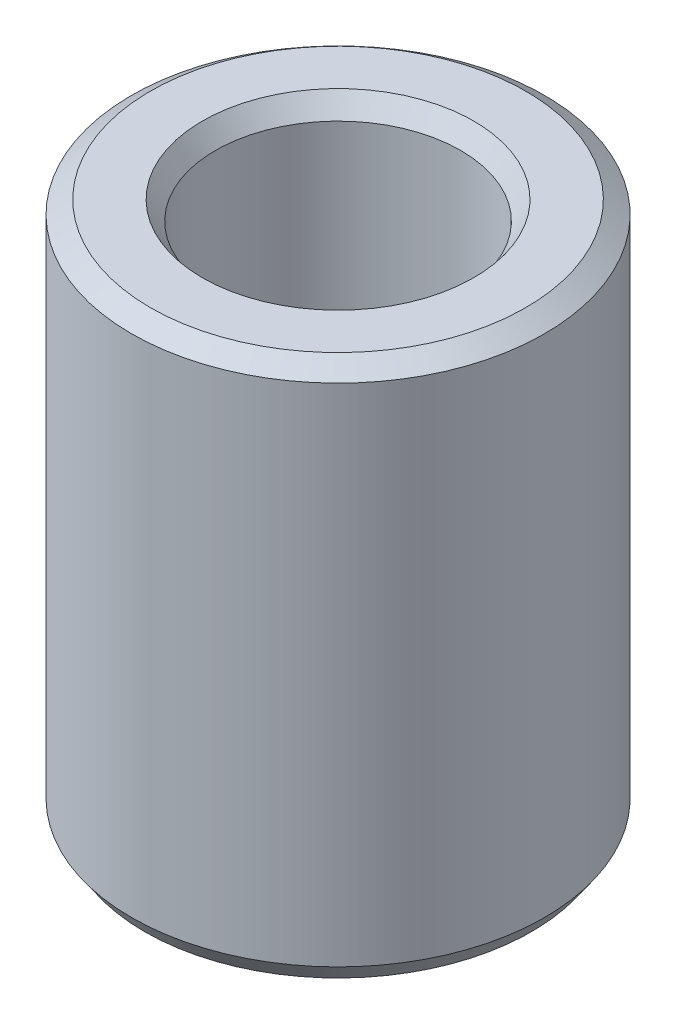
ISO-10303-21;
HEADER;
FILE_DESCRIPTION(('STEP AP214'),'2;1');
FILE_NAME('part.step','',(''),(''),'','','');
FILE_SCHEMA(('AUTOMOTIVE_DESIGN { 1 0 10303 214 1 1 1 1 }'));
ENDSEC;
DATA;
#1=APPLICATION_CONTEXT('core data for automotive mechanical design processes');
#2=APPLICATION_PROTOCOL_DEFINITION('international standard','automotive_design',2000,#1);
#3=PRODUCT_CONTEXT('',#1,'mechanical');
#4=PRODUCT('Part','Part','',(#3));
#5=PRODUCT_RELATED_PRODUCT_CATEGORY('part','',(#4));
#6=PRODUCT_DEFINITION_FORMATION('','',#4);
#7=PRODUCT_DEFINITION_CONTEXT('part definition',#1,'design');
#8=PRODUCT_DEFINITION('design','',#6,#7);
#9=PRODUCT_DEFINITION_SHAPE('','',#8);
#10=(LENGTH_UNIT() NAMED_UNIT(*) SI_UNIT(.MILLI.,.METRE.));
#11=(NAMED_UNIT(*) PLANE_ANGLE_UNIT() SI_UNIT($,.RADIAN.));
#12=(NAMED_UNIT(*) SI_UNIT($,.STERADIAN.) SOLID_ANGLE_UNIT());
#13=UNCERTAINTY_MEASURE_WITH_UNIT(LENGTH_MEASURE(1.E-05),#10,'distance_accuracy_value','');
#14=(GEOMETRIC_REPRESENTATION_CONTEXT(3) GLOBAL_UNCERTAINTY_ASSIGNED_CONTEXT((#13)) GLOBAL_UNIT_ASSIGNED_CONTEXT((#10,
#11,#12)) REPRESENTATION_CONTEXT('',''));
#15=CARTESIAN_POINT('',(0.,0.,0.));
#16=DIRECTION('',(0.,0.,1.));
#17=DIRECTION('',(1.,0.,0.));
#18=AXIS2_PLACEMENT_3D('',#15,#16,#17);
#19=CARTESIAN_POINT('',(0.,143.177631376907,0.));
#20=DIRECTION('',(0.,-1.,0.));
#21=DIRECTION('',(0.,0.,-1.));
#22=AXIS2_PLACEMENT_3D('',#19,#20,#21);
#23=CYLINDRICAL_SURFACE('',#22,55.);
#24=CARTESIAN_POINT('',(0.,5.03157090102677,0.));
#25=DIRECTION('',(0.,1.,0.));
#26=DIRECTION('',(0.,0.,1.));
#27=AXIS2_PLACEMENT_3D('',#24,#25,#26);
#28=CIRCLE('',#27,55.);
#29=CARTESIAN_POINT('',(0.,5.03157090102677,55.));
#30=VERTEX_POINT('',#29);
#31=EDGE_CURVE('E10',#30,#30,#28,.T.);
#32=ORIENTED_EDGE('',*,*,#31,.T.);
#33=EDGE_LOOP('',(#32));
#34=FACE_BOUND('',#33,.T.);
#35=CARTESIAN_POINT('',(0.,139.681117191174,0.));
#36=DIRECTION('',(0.,1.,0.));
#37=DIRECTION('',(0.,0.,1.));
#38=AXIS2_PLACEMENT_3D('',#35,#36,#37);
#39=CIRCLE('',#38,55.);
#40=CARTESIAN_POINT('',(0.,139.681117191174,55.));
#41=VERTEX_POINT('',#40);
#42=EDGE_CURVE('E50',#41,#41,#39,.F.);
#43=ORIENTED_EDGE('',*,*,#42,.T.);
#44=EDGE_LOOP('',(#43));
#45=FACE_BOUND('',#44,.T.);
#46=ADVANCED_FACE('F39',(#34,#45),#23,.T.);
#47=CARTESIAN_POINT('',(0.,143.177631376907,0.));
#48=DIRECTION('',(0.,1.,0.));
#49=DIRECTION('',(0.,0.,1.));
#50=AXIS2_PLACEMENT_3D('',#47,#48,#49);
#51=PLANE('',#50);
#52=CARTESIAN_POINT('',(0.,143.177631376907,0.));
#53=DIRECTION('',(0.,1.,0.));
#54=DIRECTION('',(0.,0.,1.));
#55=AXIS2_PLACEMENT_3D('',#52,#53,#54);
#56=CIRCLE('',#55,36.1520962345178);
#57=CARTESIAN_POINT('',(0.,143.177631376907,36.1520962345178));
#58=VERTEX_POINT('',#57);
#59=EDGE_CURVE('E58',#58,#58,#56,.F.);
#60=ORIENTED_EDGE('',*,*,#59,.T.);
#61=EDGE_LOOP('',(#60));
#62=FACE_BOUND('',#61,.T.);
#63=CARTESIAN_POINT('',(0.,143.177631376907,0.));
#64=DIRECTION('',(0.,1.,0.));
#65=DIRECTION('',(0.,0.,1.));
#66=AXIS2_PLACEMENT_3D('',#63,#64,#65);
#67=CIRCLE('',#66,49.9684290989731);
#68=CARTESIAN_POINT('',(0.,143.177631376907,49.9684290989731));
#69=VERTEX_POINT('',#68);
#70=EDGE_CURVE('E61',#69,#69,#67,.T.);
#71=ORIENTED_EDGE('',*,*,#70,.T.);
#72=EDGE_LOOP('',(#71));
#73=FACE_BOUND('',#72,.T.);
#74=ADVANCED_FACE('F88',(#62,#73),#51,.T.);
#75=CARTESIAN_POINT('',(0.,0.,0.));
#76=DIRECTION('',(0.,1.,0.));
#77=DIRECTION('',(0.,0.,1.));
#78=AXIS2_PLACEMENT_3D('',#75,#76,#77);
#79=PLANE('',#78);
#80=CARTESIAN_POINT('',(0.,0.,0.));
#81=DIRECTION('',(0.,1.,0.));
#82=DIRECTION('',(0.,0.,1.));
#83=AXIS2_PLACEMENT_3D('',#80,#81,#82);
#84=CIRCLE('',#83,37.6871529498116);
#85=CARTESIAN_POINT('',(0.,0.,37.6871529498116));
#86=VERTEX_POINT('',#85);
#87=EDGE_CURVE('E51',#86,#86,#84,.T.);
#88=ORIENTED_EDGE('',*,*,#87,.T.);
#89=EDGE_LOOP('',(#88));
#90=FACE_BOUND('',#89,.T.);
#91=CARTESIAN_POINT('',(0.,0.,0.));
#92=DIRECTION('',(0.,1.,0.));
#93=DIRECTION('',(0.,0.,1.));
#94=AXIS2_PLACEMENT_3D('',#91,#92,#93);
#95=CIRCLE('',#94,51.503485814267);
#96=CARTESIAN_POINT('',(0.,0.,51.503485814267));
#97=VERTEX_POINT('',#96);
#98=EDGE_CURVE('E54',#97,#97,#95,.F.);
#99=ORIENTED_EDGE('',*,*,#98,.T.);
#100=EDGE_LOOP('',(#99));
#101=FACE_BOUND('',#100,.T.);
#102=ADVANCED_FACE('F83',(#90,#101),#79,.F.);
#103=CARTESIAN_POINT('',(0.,143.177631376907,0.));
#104=DIRECTION('',(0.,-1.,0.));
#105=DIRECTION('',(0.,0.,-1.));
#106=AXIS2_PLACEMENT_3D('',#103,#104,#105);
#107=CYLINDRICAL_SURFACE('',#106,32.6555820487848);
#108=CARTESIAN_POINT('',(0.,138.14606047588,0.));
#109=DIRECTION('',(0.,1.,0.));
#110=DIRECTION('',(0.,0.,1.));
#111=AXIS2_PLACEMENT_3D('',#108,#109,#110);
#112=CIRCLE('',#111,32.6555820487848);
#113=CARTESIAN_POINT('',(0.,138.14606047588,32.6555820487848));
#114=VERTEX_POINT('',#113);
#115=EDGE_CURVE('E67',#114,#114,#112,.T.);
#116=ORIENTED_EDGE('',*,*,#115,.T.);
#117=EDGE_LOOP('',(#116));
#118=FACE_BOUND('',#117,.T.);
#119=CARTESIAN_POINT('',(0.,3.49651418573305,0.));
#120=DIRECTION('',(0.,1.,0.));
#121=DIRECTION('',(0.,0.,1.));
#122=AXIS2_PLACEMENT_3D('',#119,#120,#121);
#123=CIRCLE('',#122,32.6555820487848);
#124=CARTESIAN_POINT('',(0.,3.49651418573305,32.6555820487848));
#125=VERTEX_POINT('',#124);
#126=EDGE_CURVE('E69',#125,#125,#123,.F.);
#127=ORIENTED_EDGE('',*,*,#126,.T.);
#128=EDGE_LOOP('',(#127));
#129=FACE_BOUND('',#128,.T.);
#130=ADVANCED_FACE('F71',(#118,#129),#107,.F.);
#131=CARTESIAN_POINT('',(0.,138.14606047588,0.));
#132=DIRECTION('',(0.,1.,0.));
#133=DIRECTION('',(0.,0.,1.));
#134=AXIS2_PLACEMENT_3D('',#131,#132,#133);
#135=CONICAL_SURFACE('',#134,32.6555820487848,0.607305066191446);
#136=ORIENTED_EDGE('',*,*,#59,.F.);
#137=EDGE_LOOP('',(#136));
#138=FACE_BOUND('',#137,.T.);
#139=ORIENTED_EDGE('',*,*,#115,.F.);
#140=EDGE_LOOP('',(#139));
#141=FACE_BOUND('',#140,.T.);
#142=ADVANCED_FACE('F77',(#138,#141),#135,.F.);
#143=CARTESIAN_POINT('',(0.,0.,0.));
#144=DIRECTION('',(0.,-1.,0.));
#145=DIRECTION('',(0.,0.,-1.));
#146=AXIS2_PLACEMENT_3D('',#143,#144,#145);
#147=CONICAL_SURFACE('',#146,37.6871529498116,0.963491260603451);
#148=ORIENTED_EDGE('',*,*,#126,.F.);
#149=EDGE_LOOP('',(#148));
#150=FACE_BOUND('',#149,.T.);
#151=ORIENTED_EDGE('',*,*,#87,.F.);
#152=EDGE_LOOP('',(#151));
#153=FACE_BOUND('',#152,.T.);
#154=ADVANCED_FACE('F73',(#150,#153),#147,.F.);
#155=CARTESIAN_POINT('',(0.,5.03157090102677,0.));
#156=DIRECTION('',(0.,1.,0.));
#157=DIRECTION('',(0.,0.,1.));
#158=AXIS2_PLACEMENT_3D('',#155,#156,#157);
#159=CONICAL_SURFACE('',#158,55.,0.607305066191447);
#160=ORIENTED_EDGE('',*,*,#98,.F.);
#161=EDGE_LOOP('',(#160));
#162=FACE_BOUND('',#161,.T.);
#163=ORIENTED_EDGE('',*,*,#31,.F.);
#164=EDGE_LOOP('',(#163));
#165=FACE_BOUND('',#164,.T.);
#166=ADVANCED_FACE('F76',(#162,#165),#159,.T.);
#167=CARTESIAN_POINT('',(0.,143.177631376907,0.));
#168=DIRECTION('',(0.,-1.,0.));
#169=DIRECTION('',(0.,0.,-1.));
#170=AXIS2_PLACEMENT_3D('',#167,#168,#169);
#171=CONICAL_SURFACE('',#170,49.9684290989731,0.96349126060345);
#172=ORIENTED_EDGE('',*,*,#42,.F.);
#173=EDGE_LOOP('',(#172));
#174=FACE_BOUND('',#173,.T.);
#175=ORIENTED_EDGE('',*,*,#70,.F.);
#176=EDGE_LOOP('',(#175));
#177=FACE_BOUND('',#176,.T.);
#178=ADVANCED_FACE('F45',(#174,#177),#171,.T.);
#179=CLOSED_SHELL('',(#46,#74,#102,#130,#142,#154,#166,#178));
#180=MANIFOLD_SOLID_BREP('B2',#179);
#181=ADVANCED_BREP_SHAPE_REPRESENTATION('',(#18,#180),#14);
#182=SHAPE_DEFINITION_REPRESENTATION(#9,#181);
ENDSEC;
END-ISO-10303-21;
